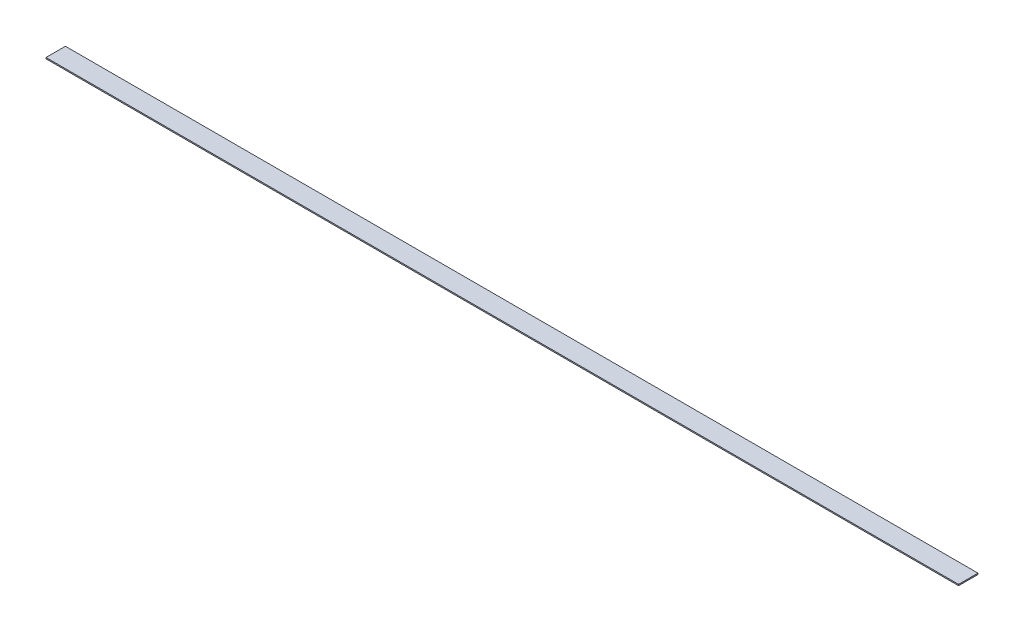
ISO-10303-21;
HEADER;
FILE_DESCRIPTION(('STEP AP214'),'2;1');
FILE_NAME('part.step','',(''),(''),'','','');
FILE_SCHEMA(('AUTOMOTIVE_DESIGN { 1 0 10303 214 1 1 1 1 }'));
ENDSEC;
DATA;
#1=APPLICATION_CONTEXT('core data for automotive mechanical design processes');
#2=APPLICATION_PROTOCOL_DEFINITION('international standard','automotive_design',2000,#1);
#3=PRODUCT_CONTEXT('',#1,'mechanical');
#4=PRODUCT('Part','Part','',(#3));
#5=PRODUCT_RELATED_PRODUCT_CATEGORY('part','',(#4));
#6=PRODUCT_DEFINITION_FORMATION('','',#4);
#7=PRODUCT_DEFINITION_CONTEXT('part definition',#1,'design');
#8=PRODUCT_DEFINITION('design','',#6,#7);
#9=PRODUCT_DEFINITION_SHAPE('','',#8);
#10=(LENGTH_UNIT() NAMED_UNIT(*) SI_UNIT(.MILLI.,.METRE.));
#11=(NAMED_UNIT(*) PLANE_ANGLE_UNIT() SI_UNIT($,.RADIAN.));
#12=(NAMED_UNIT(*) SI_UNIT($,.STERADIAN.) SOLID_ANGLE_UNIT());
#13=UNCERTAINTY_MEASURE_WITH_UNIT(LENGTH_MEASURE(1.E-05),#10,'distance_accuracy_value','');
#14=(GEOMETRIC_REPRESENTATION_CONTEXT(3) GLOBAL_UNCERTAINTY_ASSIGNED_CONTEXT((#13)) GLOBAL_UNIT_ASSIGNED_CONTEXT((#10,
#11,#12)) REPRESENTATION_CONTEXT('',''));
#15=CARTESIAN_POINT('',(0.,0.,0.));
#16=DIRECTION('',(0.,0.,1.));
#17=DIRECTION('',(1.,0.,0.));
#18=AXIS2_PLACEMENT_3D('',#15,#16,#17);
#19=CARTESIAN_POINT('',(596.900000000001,1.5875,-12.7));
#20=DIRECTION('',(-1.,0.,0.));
#21=DIRECTION('',(0.,0.,1.));
#22=AXIS2_PLACEMENT_3D('',#19,#20,#21);
#23=PLANE('',#22);
#24=DIRECTION('',(0.,0.,-1.));
#25=VECTOR('',#24,1.);
#26=CARTESIAN_POINT('',(596.900000000001,0.,-12.7));
#27=LINE('',#26,#25);
#28=CARTESIAN_POINT('',(596.900000000001,0.,12.7));
#29=VERTEX_POINT('',#28);
#30=CARTESIAN_POINT('',(596.900000000001,0.,-12.7));
#31=VERTEX_POINT('',#30);
#32=EDGE_CURVE('E108',#29,#31,#27,.T.);
#33=ORIENTED_EDGE('',*,*,#32,.T.);
#34=DIRECTION('',(0.,-1.,0.));
#35=VECTOR('',#34,1.);
#36=CARTESIAN_POINT('',(596.900000000001,1.5875,-12.7));
#37=LINE('',#36,#35);
#38=CARTESIAN_POINT('',(596.900000000001,1.5875,-12.7));
#39=VERTEX_POINT('',#38);
#40=EDGE_CURVE('E11',#39,#31,#37,.T.);
#41=ORIENTED_EDGE('',*,*,#40,.F.);
#42=DIRECTION('',(0.,0.,-1.));
#43=VECTOR('',#42,1.);
#44=CARTESIAN_POINT('',(596.900000000001,1.5875,-12.7));
#45=LINE('',#44,#43);
#46=CARTESIAN_POINT('',(596.900000000001,1.5875,12.7));
#47=VERTEX_POINT('',#46);
#48=EDGE_CURVE('E94',#47,#39,#45,.T.);
#49=ORIENTED_EDGE('',*,*,#48,.F.);
#50=DIRECTION('',(0.,-1.,0.));
#51=VECTOR('',#50,1.);
#52=CARTESIAN_POINT('',(596.900000000001,1.5875,12.7));
#53=LINE('',#52,#51);
#54=EDGE_CURVE('E104',#47,#29,#53,.T.);
#55=ORIENTED_EDGE('',*,*,#54,.T.);
#56=EDGE_LOOP('',(#33,#41,#49,#55));
#57=FACE_BOUND('',#56,.T.);
#58=ADVANCED_FACE('F38',(#57),#23,.F.);
#59=CARTESIAN_POINT('',(-596.899999999999,1.5875,-12.7));
#60=DIRECTION('',(0.,0.,1.));
#61=DIRECTION('',(1.,0.,0.));
#62=AXIS2_PLACEMENT_3D('',#59,#60,#61);
#63=PLANE('',#62);
#64=DIRECTION('',(-1.,0.,0.));
#65=VECTOR('',#64,1.);
#66=CARTESIAN_POINT('',(-596.899999999999,0.,-12.7));
#67=LINE('',#66,#65);
#68=CARTESIAN_POINT('',(-596.899999999999,0.,-12.7));
#69=VERTEX_POINT('',#68);
#70=EDGE_CURVE('E99',#31,#69,#67,.T.);
#71=ORIENTED_EDGE('',*,*,#70,.T.);
#72=DIRECTION('',(0.,-1.,0.));
#73=VECTOR('',#72,1.);
#74=CARTESIAN_POINT('',(-596.899999999999,1.5875,-12.7));
#75=LINE('',#74,#73);
#76=CARTESIAN_POINT('',(-596.899999999999,1.5875,-12.7));
#77=VERTEX_POINT('',#76);
#78=EDGE_CURVE('E47',#77,#69,#75,.T.);
#79=ORIENTED_EDGE('',*,*,#78,.F.);
#80=DIRECTION('',(-1.,0.,0.));
#81=VECTOR('',#80,1.);
#82=CARTESIAN_POINT('',(-596.899999999999,1.5875,-12.7));
#83=LINE('',#82,#81);
#84=EDGE_CURVE('E89',#39,#77,#83,.T.);
#85=ORIENTED_EDGE('',*,*,#84,.F.);
#86=ORIENTED_EDGE('',*,*,#40,.T.);
#87=EDGE_LOOP('',(#71,#79,#85,#86));
#88=FACE_BOUND('',#87,.T.);
#89=ADVANCED_FACE('F98',(#88),#63,.F.);
#90=CARTESIAN_POINT('',(-596.899999999999,1.5875,-12.7));
#91=DIRECTION('',(1.,0.,0.));
#92=DIRECTION('',(0.,0.,-1.));
#93=AXIS2_PLACEMENT_3D('',#90,#91,#92);
#94=PLANE('',#93);
#95=DIRECTION('',(0.,0.,1.));
#96=VECTOR('',#95,1.);
#97=CARTESIAN_POINT('',(-596.899999999999,0.,-12.7));
#98=LINE('',#97,#96);
#99=CARTESIAN_POINT('',(-596.899999999999,0.,12.7));
#100=VERTEX_POINT('',#99);
#101=EDGE_CURVE('E75',#69,#100,#98,.T.);
#102=ORIENTED_EDGE('',*,*,#101,.T.);
#103=DIRECTION('',(0.,-1.,0.));
#104=VECTOR('',#103,1.);
#105=CARTESIAN_POINT('',(-596.899999999999,1.5875,12.7));
#106=LINE('',#105,#104);
#107=CARTESIAN_POINT('',(-596.899999999999,1.5875,12.7));
#108=VERTEX_POINT('',#107);
#109=EDGE_CURVE('E100',#108,#100,#106,.T.);
#110=ORIENTED_EDGE('',*,*,#109,.F.);
#111=DIRECTION('',(0.,0.,1.));
#112=VECTOR('',#111,1.);
#113=CARTESIAN_POINT('',(-596.899999999999,1.5875,-12.7));
#114=LINE('',#113,#112);
#115=EDGE_CURVE('E92',#77,#108,#114,.T.);
#116=ORIENTED_EDGE('',*,*,#115,.F.);
#117=ORIENTED_EDGE('',*,*,#78,.T.);
#118=EDGE_LOOP('',(#102,#110,#116,#117));
#119=FACE_BOUND('',#118,.T.);
#120=ADVANCED_FACE('F101',(#119),#94,.F.);
#121=CARTESIAN_POINT('',(-596.899999999999,1.5875,12.7));
#122=DIRECTION('',(0.,0.,-1.));
#123=DIRECTION('',(-1.,0.,0.));
#124=AXIS2_PLACEMENT_3D('',#121,#122,#123);
#125=PLANE('',#124);
#126=DIRECTION('',(1.,0.,0.));
#127=VECTOR('',#126,1.);
#128=CARTESIAN_POINT('',(-596.899999999999,0.,12.7));
#129=LINE('',#128,#127);
#130=EDGE_CURVE('E82',#100,#29,#129,.T.);
#131=ORIENTED_EDGE('',*,*,#130,.T.);
#132=ORIENTED_EDGE('',*,*,#54,.F.);
#133=DIRECTION('',(1.,0.,0.));
#134=VECTOR('',#133,1.);
#135=CARTESIAN_POINT('',(-596.899999999999,1.5875,12.7));
#136=LINE('',#135,#134);
#137=EDGE_CURVE('E58',#108,#47,#136,.T.);
#138=ORIENTED_EDGE('',*,*,#137,.F.);
#139=ORIENTED_EDGE('',*,*,#109,.T.);
#140=EDGE_LOOP('',(#131,#132,#138,#139));
#141=FACE_BOUND('',#140,.T.);
#142=ADVANCED_FACE('F119',(#141),#125,.F.);
#143=CARTESIAN_POINT('',(0.,1.5875,0.));
#144=DIRECTION('',(0.,1.,0.));
#145=DIRECTION('',(0.,0.,1.));
#146=AXIS2_PLACEMENT_3D('',#143,#144,#145);
#147=PLANE('',#146);
#148=ORIENTED_EDGE('',*,*,#48,.T.);
#149=ORIENTED_EDGE('',*,*,#84,.T.);
#150=ORIENTED_EDGE('',*,*,#115,.T.);
#151=ORIENTED_EDGE('',*,*,#137,.T.);
#152=EDGE_LOOP('',(#148,#149,#150,#151));
#153=FACE_BOUND('',#152,.T.);
#154=ADVANCED_FACE('F90',(#153),#147,.T.);
#155=CARTESIAN_POINT('',(0.,0.,0.));
#156=DIRECTION('',(0.,1.,0.));
#157=DIRECTION('',(0.,0.,1.));
#158=AXIS2_PLACEMENT_3D('',#155,#156,#157);
#159=PLANE('',#158);
#160=ORIENTED_EDGE('',*,*,#32,.F.);
#161=ORIENTED_EDGE('',*,*,#130,.F.);
#162=ORIENTED_EDGE('',*,*,#101,.F.);
#163=ORIENTED_EDGE('',*,*,#70,.F.);
#164=EDGE_LOOP('',(#160,#161,#162,#163));
#165=FACE_BOUND('',#164,.T.);
#166=ADVANCED_FACE('F122',(#165),#159,.F.);
#167=CLOSED_SHELL('',(#58,#89,#120,#142,#154,#166));
#168=MANIFOLD_SOLID_BREP('B2',#167);
#169=ADVANCED_BREP_SHAPE_REPRESENTATION('',(#18,#168),#14);
#170=SHAPE_DEFINITION_REPRESENTATION(#9,#169);
ENDSEC;
END-ISO-10303-21;
